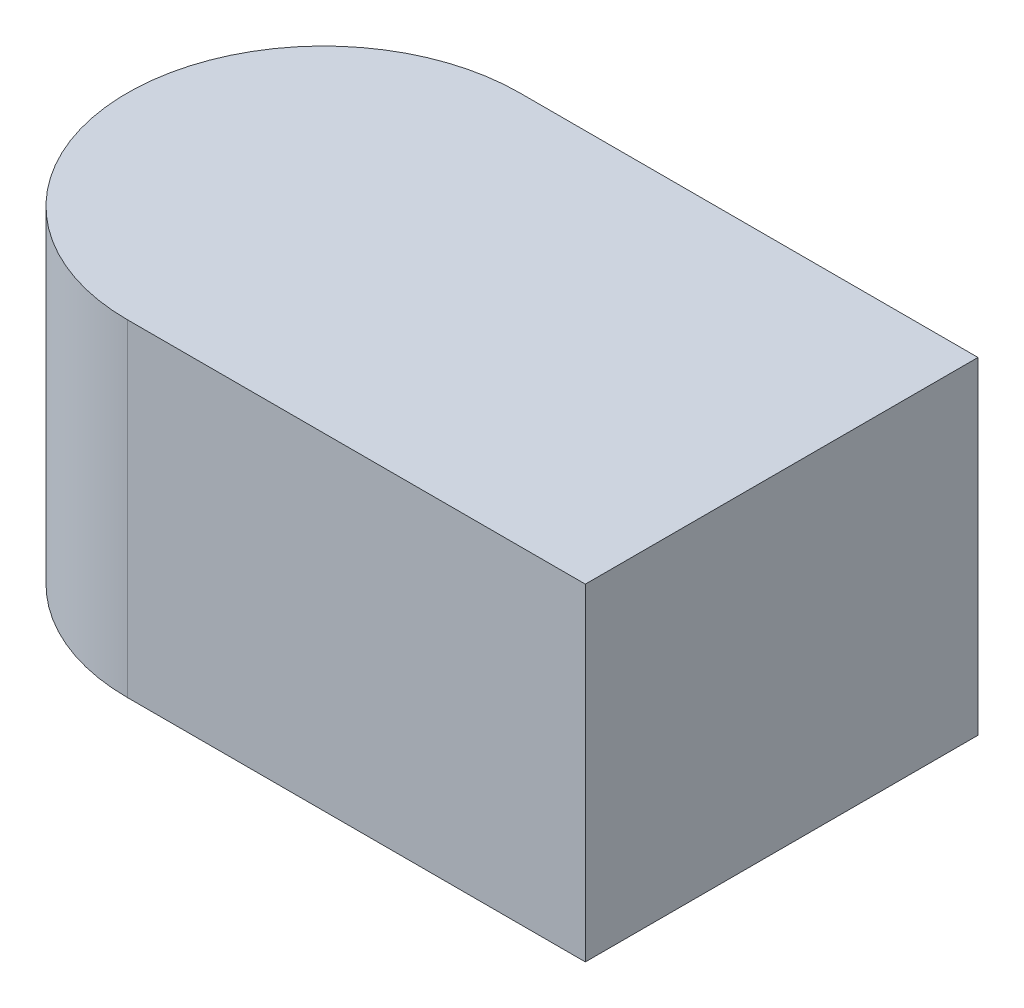
ISO-10303-21;
HEADER;
FILE_DESCRIPTION(('STEP AP214'),'2;1');
FILE_NAME('part.step','',(''),(''),'','','');
FILE_SCHEMA(('AUTOMOTIVE_DESIGN { 1 0 10303 214 1 1 1 1 }'));
ENDSEC;
DATA;
#1=APPLICATION_CONTEXT('core data for automotive mechanical design processes');
#2=APPLICATION_PROTOCOL_DEFINITION('international standard','automotive_design',2000,#1);
#3=PRODUCT_CONTEXT('',#1,'mechanical');
#4=PRODUCT('Part','Part','',(#3));
#5=PRODUCT_RELATED_PRODUCT_CATEGORY('part','',(#4));
#6=PRODUCT_DEFINITION_FORMATION('','',#4);
#7=PRODUCT_DEFINITION_CONTEXT('part definition',#1,'design');
#8=PRODUCT_DEFINITION('design','',#6,#7);
#9=PRODUCT_DEFINITION_SHAPE('','',#8);
#10=(LENGTH_UNIT() NAMED_UNIT(*) SI_UNIT(.MILLI.,.METRE.));
#11=(NAMED_UNIT(*) PLANE_ANGLE_UNIT() SI_UNIT($,.RADIAN.));
#12=(NAMED_UNIT(*) SI_UNIT($,.STERADIAN.) SOLID_ANGLE_UNIT());
#13=UNCERTAINTY_MEASURE_WITH_UNIT(LENGTH_MEASURE(1.E-05),#10,'distance_accuracy_value','');
#14=(GEOMETRIC_REPRESENTATION_CONTEXT(3) GLOBAL_UNCERTAINTY_ASSIGNED_CONTEXT((#13)) GLOBAL_UNIT_ASSIGNED_CONTEXT((#10,
#11,#12)) REPRESENTATION_CONTEXT('',''));
#15=CARTESIAN_POINT('',(0.,0.,0.));
#16=DIRECTION('',(0.,0.,1.));
#17=DIRECTION('',(1.,0.,0.));
#18=AXIS2_PLACEMENT_3D('',#15,#16,#17);
#19=CARTESIAN_POINT('',(0.,0.,0.));
#20=DIRECTION('',(0.,1.,0.));
#21=DIRECTION('',(1.,0.,0.));
#22=AXIS2_PLACEMENT_3D('',#19,#20,#21);
#23=PLANE('',#22);
#24=DIRECTION('',(0.,0.,-1.));
#25=VECTOR('',#24,1.);
#26=CARTESIAN_POINT('',(1.75,0.,-1.63));
#27=LINE('',#26,#25);
#28=CARTESIAN_POINT('',(1.75,0.,-1.63));
#29=VERTEX_POINT('',#28);
#30=CARTESIAN_POINT('',(1.75,0.,-1.87));
#31=VERTEX_POINT('',#30);
#32=EDGE_CURVE('E11',#29,#31,#27,.T.);
#33=ORIENTED_EDGE('',*,*,#32,.F.);
#34=DIRECTION('',(1.,0.,0.));
#35=VECTOR('',#34,1.);
#36=CARTESIAN_POINT('',(1.47,0.,-1.63));
#37=LINE('',#36,#35);
#38=CARTESIAN_POINT('',(1.47,0.,-1.63));
#39=VERTEX_POINT('',#38);
#40=EDGE_CURVE('E24',#39,#29,#37,.T.);
#41=ORIENTED_EDGE('',*,*,#40,.F.);
#42=CARTESIAN_POINT('',(1.47,0.,-1.75));
#43=DIRECTION('',(0.,1.,0.));
#44=DIRECTION('',(0.,0.,-1.));
#45=AXIS2_PLACEMENT_3D('',#42,#43,#44);
#46=CIRCLE('',#45,0.12);
#47=CARTESIAN_POINT('',(1.47,0.,-1.87));
#48=VERTEX_POINT('',#47);
#49=EDGE_CURVE('E61',#48,#39,#46,.T.);
#50=ORIENTED_EDGE('',*,*,#49,.F.);
#51=DIRECTION('',(-1.,0.,0.));
#52=VECTOR('',#51,1.);
#53=CARTESIAN_POINT('',(1.75,0.,-1.87));
#54=LINE('',#53,#52);
#55=EDGE_CURVE('E37',#31,#48,#54,.T.);
#56=ORIENTED_EDGE('',*,*,#55,.F.);
#57=EDGE_LOOP('',(#33,#41,#50,#56));
#58=FACE_BOUND('',#57,.T.);
#59=ADVANCED_FACE('F17',(#58),#23,.F.);
#60=CARTESIAN_POINT('',(1.75,0.,-1.87));
#61=DIRECTION('',(0.,0.,-1.));
#62=DIRECTION('',(-1.,0.,0.));
#63=AXIS2_PLACEMENT_3D('',#60,#61,#62);
#64=PLANE('',#63);
#65=DIRECTION('',(0.,1.,0.));
#66=VECTOR('',#65,1.);
#67=CARTESIAN_POINT('',(1.47,0.,-1.87));
#68=LINE('',#67,#66);
#69=CARTESIAN_POINT('',(1.47,0.2,-1.87));
#70=VERTEX_POINT('',#69);
#71=EDGE_CURVE('E84',#48,#70,#68,.T.);
#72=ORIENTED_EDGE('',*,*,#71,.T.);
#73=DIRECTION('',(-1.,0.,0.));
#74=VECTOR('',#73,1.);
#75=CARTESIAN_POINT('',(1.75,0.2,-1.87));
#76=LINE('',#75,#74);
#77=CARTESIAN_POINT('',(1.75,0.2,-1.87));
#78=VERTEX_POINT('',#77);
#79=EDGE_CURVE('E74',#78,#70,#76,.T.);
#80=ORIENTED_EDGE('',*,*,#79,.F.);
#81=DIRECTION('',(0.,1.,0.));
#82=VECTOR('',#81,1.);
#83=CARTESIAN_POINT('',(1.75,0.,-1.87));
#84=LINE('',#83,#82);
#85=EDGE_CURVE('E81',#31,#78,#84,.T.);
#86=ORIENTED_EDGE('',*,*,#85,.F.);
#87=ORIENTED_EDGE('',*,*,#55,.T.);
#88=EDGE_LOOP('',(#72,#80,#86,#87));
#89=FACE_BOUND('',#88,.T.);
#90=ADVANCED_FACE('F89',(#89),#64,.T.);
#91=CARTESIAN_POINT('',(1.75,0.,-1.63));
#92=DIRECTION('',(1.,0.,0.));
#93=DIRECTION('',(0.,0.,-1.));
#94=AXIS2_PLACEMENT_3D('',#91,#92,#93);
#95=PLANE('',#94);
#96=ORIENTED_EDGE('',*,*,#85,.T.);
#97=DIRECTION('',(0.,0.,-1.));
#98=VECTOR('',#97,1.);
#99=CARTESIAN_POINT('',(1.75,0.2,-1.63));
#100=LINE('',#99,#98);
#101=CARTESIAN_POINT('',(1.75,0.2,-1.63));
#102=VERTEX_POINT('',#101);
#103=EDGE_CURVE('E79',#102,#78,#100,.T.);
#104=ORIENTED_EDGE('',*,*,#103,.F.);
#105=DIRECTION('',(0.,1.,0.));
#106=VECTOR('',#105,1.);
#107=CARTESIAN_POINT('',(1.75,0.,-1.63));
#108=LINE('',#107,#106);
#109=EDGE_CURVE('E67',#29,#102,#108,.T.);
#110=ORIENTED_EDGE('',*,*,#109,.F.);
#111=ORIENTED_EDGE('',*,*,#32,.T.);
#112=EDGE_LOOP('',(#96,#104,#110,#111));
#113=FACE_BOUND('',#112,.T.);
#114=ADVANCED_FACE('F91',(#113),#95,.T.);
#115=CARTESIAN_POINT('',(1.47,0.,-1.63));
#116=DIRECTION('',(0.,0.,1.));
#117=DIRECTION('',(1.,0.,0.));
#118=AXIS2_PLACEMENT_3D('',#115,#116,#117);
#119=PLANE('',#118);
#120=ORIENTED_EDGE('',*,*,#109,.T.);
#121=DIRECTION('',(1.,0.,0.));
#122=VECTOR('',#121,1.);
#123=CARTESIAN_POINT('',(1.47,0.2,-1.63));
#124=LINE('',#123,#122);
#125=CARTESIAN_POINT('',(1.47,0.2,-1.63));
#126=VERTEX_POINT('',#125);
#127=EDGE_CURVE('E62',#126,#102,#124,.T.);
#128=ORIENTED_EDGE('',*,*,#127,.F.);
#129=DIRECTION('',(0.,1.,0.));
#130=VECTOR('',#129,1.);
#131=CARTESIAN_POINT('',(1.47,0.,-1.63));
#132=LINE('',#131,#130);
#133=EDGE_CURVE('E55',#39,#126,#132,.T.);
#134=ORIENTED_EDGE('',*,*,#133,.F.);
#135=ORIENTED_EDGE('',*,*,#40,.T.);
#136=EDGE_LOOP('',(#120,#128,#134,#135));
#137=FACE_BOUND('',#136,.T.);
#138=ADVANCED_FACE('F65',(#137),#119,.T.);
#139=CARTESIAN_POINT('',(1.47,0.,-1.75));
#140=DIRECTION('',(0.,1.,0.));
#141=DIRECTION('',(1.,0.,0.));
#142=AXIS2_PLACEMENT_3D('',#139,#140,#141);
#143=CYLINDRICAL_SURFACE('',#142,0.12);
#144=ORIENTED_EDGE('',*,*,#133,.T.);
#145=CARTESIAN_POINT('',(1.47,0.2,-1.75));
#146=DIRECTION('',(0.,1.,0.));
#147=DIRECTION('',(0.,0.,-1.));
#148=AXIS2_PLACEMENT_3D('',#145,#146,#147);
#149=CIRCLE('',#148,0.12);
#150=EDGE_CURVE('E60',#70,#126,#149,.T.);
#151=ORIENTED_EDGE('',*,*,#150,.F.);
#152=ORIENTED_EDGE('',*,*,#71,.F.);
#153=ORIENTED_EDGE('',*,*,#49,.T.);
#154=EDGE_LOOP('',(#144,#151,#152,#153));
#155=FACE_BOUND('',#154,.T.);
#156=ADVANCED_FACE('F57',(#155),#143,.T.);
#157=CARTESIAN_POINT('',(0.,0.2,0.));
#158=DIRECTION('',(0.,1.,0.));
#159=DIRECTION('',(1.,0.,0.));
#160=AXIS2_PLACEMENT_3D('',#157,#158,#159);
#161=PLANE('',#160);
#162=ORIENTED_EDGE('',*,*,#150,.T.);
#163=ORIENTED_EDGE('',*,*,#127,.T.);
#164=ORIENTED_EDGE('',*,*,#103,.T.);
#165=ORIENTED_EDGE('',*,*,#79,.T.);
#166=EDGE_LOOP('',(#162,#163,#164,#165));
#167=FACE_BOUND('',#166,.T.);
#168=ADVANCED_FACE('F72',(#167),#161,.T.);
#169=CLOSED_SHELL('',(#59,#90,#114,#138,#156,#168));
#170=MANIFOLD_SOLID_BREP('B1',#169);
#171=ADVANCED_BREP_SHAPE_REPRESENTATION('',(#18,#170),#14);
#172=SHAPE_DEFINITION_REPRESENTATION(#9,#171);
ENDSEC;
END-ISO-10303-21;
